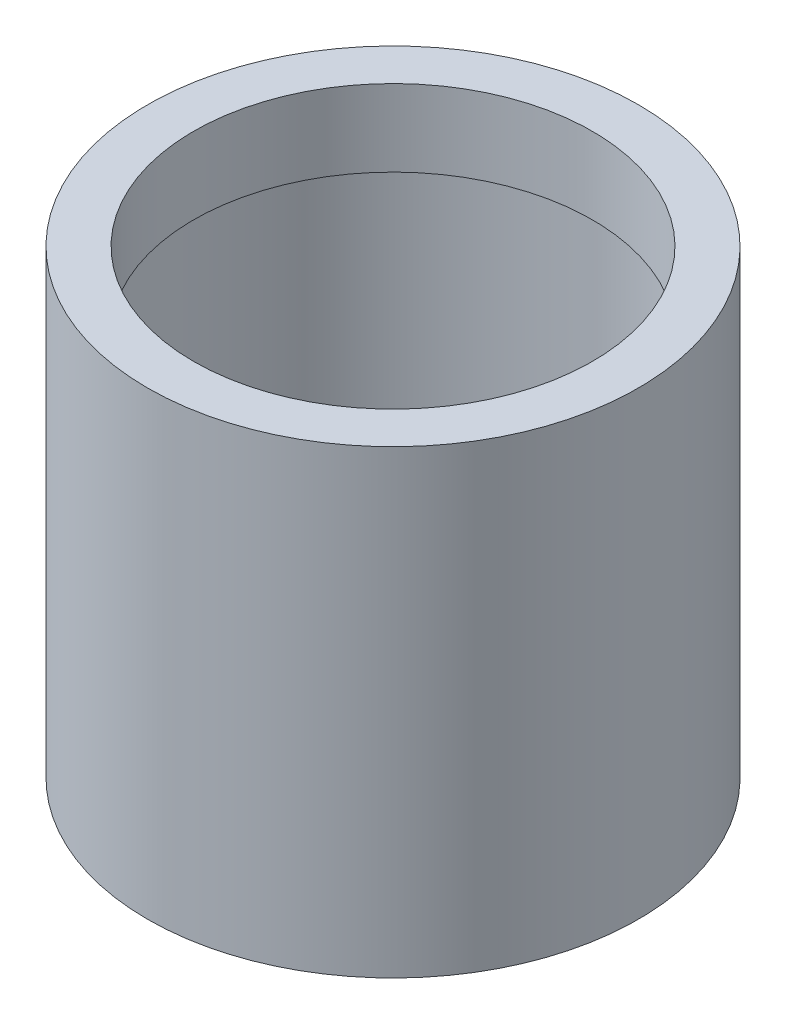
ISO-10303-21;
HEADER;
FILE_DESCRIPTION(('STEP AP214'),'2;1');
FILE_NAME('part.step','',(''),(''),'','','');
FILE_SCHEMA(('AUTOMOTIVE_DESIGN { 1 0 10303 214 1 1 1 1 }'));
ENDSEC;
DATA;
#1=APPLICATION_CONTEXT('core data for automotive mechanical design processes');
#2=APPLICATION_PROTOCOL_DEFINITION('international standard','automotive_design',2000,#1);
#3=PRODUCT_CONTEXT('',#1,'mechanical');
#4=PRODUCT('Part','Part','',(#3));
#5=PRODUCT_RELATED_PRODUCT_CATEGORY('part','',(#4));
#6=PRODUCT_DEFINITION_FORMATION('','',#4);
#7=PRODUCT_DEFINITION_CONTEXT('part definition',#1,'design');
#8=PRODUCT_DEFINITION('design','',#6,#7);
#9=PRODUCT_DEFINITION_SHAPE('','',#8);
#10=(LENGTH_UNIT() NAMED_UNIT(*) SI_UNIT(.MILLI.,.METRE.));
#11=(NAMED_UNIT(*) PLANE_ANGLE_UNIT() SI_UNIT($,.RADIAN.));
#12=(NAMED_UNIT(*) SI_UNIT($,.STERADIAN.) SOLID_ANGLE_UNIT());
#13=UNCERTAINTY_MEASURE_WITH_UNIT(LENGTH_MEASURE(1.E-05),#10,'distance_accuracy_value','');
#14=(GEOMETRIC_REPRESENTATION_CONTEXT(3) GLOBAL_UNCERTAINTY_ASSIGNED_CONTEXT((#13)) GLOBAL_UNIT_ASSIGNED_CONTEXT((#10,
#11,#12)) REPRESENTATION_CONTEXT('',''));
#15=CARTESIAN_POINT('',(0.,0.,0.));
#16=DIRECTION('',(0.,0.,1.));
#17=DIRECTION('',(1.,0.,0.));
#18=AXIS2_PLACEMENT_3D('',#15,#16,#17);
#19=CARTESIAN_POINT('',(0.,0.,0.));
#20=DIRECTION('',(0.,1.,0.));
#21=DIRECTION('',(0.,0.,1.));
#22=AXIS2_PLACEMENT_3D('',#19,#20,#21);
#23=PLANE('',#22);
#24=CARTESIAN_POINT('',(0.,0.,0.));
#25=DIRECTION('',(0.,1.,0.));
#26=DIRECTION('',(0.,0.,1.));
#27=AXIS2_PLACEMENT_3D('',#24,#25,#26);
#28=CIRCLE('',#27,16.);
#29=CARTESIAN_POINT('',(0.,0.,16.));
#30=VERTEX_POINT('',#29);
#31=EDGE_CURVE('E10',#30,#30,#28,.T.);
#32=ORIENTED_EDGE('',*,*,#31,.F.);
#33=EDGE_LOOP('',(#32));
#34=FACE_BOUND('',#33,.T.);
#35=CARTESIAN_POINT('',(0.,0.,0.));
#36=DIRECTION('',(0.,1.,0.));
#37=DIRECTION('',(0.,0.,1.));
#38=AXIS2_PLACEMENT_3D('',#35,#36,#37);
#39=CIRCLE('',#38,14.5);
#40=CARTESIAN_POINT('',(0.,0.,14.5));
#41=VERTEX_POINT('',#40);
#42=EDGE_CURVE('E39',#41,#41,#39,.T.);
#43=ORIENTED_EDGE('',*,*,#42,.T.);
#44=EDGE_LOOP('',(#43));
#45=FACE_BOUND('',#44,.T.);
#46=ADVANCED_FACE('F32',(#34,#45),#23,.F.);
#47=CARTESIAN_POINT('',(0.,25.,0.));
#48=DIRECTION('',(0.,-1.,0.));
#49=DIRECTION('',(0.,0.,-1.));
#50=AXIS2_PLACEMENT_3D('',#47,#48,#49);
#51=CYLINDRICAL_SURFACE('',#50,16.);
#52=ORIENTED_EDGE('',*,*,#31,.T.);
#53=EDGE_LOOP('',(#52));
#54=FACE_BOUND('',#53,.T.);
#55=CARTESIAN_POINT('',(0.,30.,0.));
#56=DIRECTION('',(0.,1.,0.));
#57=DIRECTION('',(0.,0.,1.));
#58=AXIS2_PLACEMENT_3D('',#55,#56,#57);
#59=CIRCLE('',#58,16.);
#60=CARTESIAN_POINT('',(0.,30.,16.));
#61=VERTEX_POINT('',#60);
#62=EDGE_CURVE('E47',#61,#61,#59,.T.);
#63=ORIENTED_EDGE('',*,*,#62,.F.);
#64=EDGE_LOOP('',(#63));
#65=FACE_BOUND('',#64,.T.);
#66=ADVANCED_FACE('F34',(#54,#65),#51,.T.);
#67=CARTESIAN_POINT('',(0.,25.,0.));
#68=DIRECTION('',(0.,-1.,0.));
#69=DIRECTION('',(0.,0.,-1.));
#70=AXIS2_PLACEMENT_3D('',#67,#68,#69);
#71=CYLINDRICAL_SURFACE('',#70,14.5);
#72=CARTESIAN_POINT('',(0.,25.,0.));
#73=DIRECTION('',(0.,1.,0.));
#74=DIRECTION('',(0.,0.,1.));
#75=AXIS2_PLACEMENT_3D('',#72,#73,#74);
#76=CIRCLE('',#75,14.5);
#77=CARTESIAN_POINT('',(0.,25.,14.5));
#78=VERTEX_POINT('',#77);
#79=EDGE_CURVE('E43',#78,#78,#76,.T.);
#80=ORIENTED_EDGE('',*,*,#79,.T.);
#81=EDGE_LOOP('',(#80));
#82=FACE_BOUND('',#81,.T.);
#83=ORIENTED_EDGE('',*,*,#42,.F.);
#84=EDGE_LOOP('',(#83));
#85=FACE_BOUND('',#84,.T.);
#86=ADVANCED_FACE('F65',(#82,#85),#71,.F.);
#87=CARTESIAN_POINT('',(0.,30.,0.));
#88=DIRECTION('',(0.,1.,0.));
#89=DIRECTION('',(0.,0.,1.));
#90=AXIS2_PLACEMENT_3D('',#87,#88,#89);
#91=PLANE('',#90);
#92=ORIENTED_EDGE('',*,*,#62,.T.);
#93=EDGE_LOOP('',(#92));
#94=FACE_BOUND('',#93,.T.);
#95=CARTESIAN_POINT('',(0.,30.,0.));
#96=DIRECTION('',(0.,1.,0.));
#97=DIRECTION('',(0.,0.,1.));
#98=AXIS2_PLACEMENT_3D('',#95,#96,#97);
#99=CIRCLE('',#98,13.);
#100=CARTESIAN_POINT('',(0.,30.,13.));
#101=VERTEX_POINT('',#100);
#102=EDGE_CURVE('E52',#101,#101,#99,.T.);
#103=ORIENTED_EDGE('',*,*,#102,.F.);
#104=EDGE_LOOP('',(#103));
#105=FACE_BOUND('',#104,.T.);
#106=ADVANCED_FACE('F62',(#94,#105),#91,.T.);
#107=CARTESIAN_POINT('',(0.,25.,0.));
#108=DIRECTION('',(0.,1.,0.));
#109=DIRECTION('',(0.,0.,1.));
#110=AXIS2_PLACEMENT_3D('',#107,#108,#109);
#111=PLANE('',#110);
#112=ORIENTED_EDGE('',*,*,#79,.F.);
#113=EDGE_LOOP('',(#112));
#114=FACE_BOUND('',#113,.T.);
#115=CARTESIAN_POINT('',(0.,25.,0.));
#116=DIRECTION('',(0.,1.,0.));
#117=DIRECTION('',(0.,0.,1.));
#118=AXIS2_PLACEMENT_3D('',#115,#116,#117);
#119=CIRCLE('',#118,13.);
#120=CARTESIAN_POINT('',(0.,25.,13.));
#121=VERTEX_POINT('',#120);
#122=EDGE_CURVE('E53',#121,#121,#119,.T.);
#123=ORIENTED_EDGE('',*,*,#122,.T.);
#124=EDGE_LOOP('',(#123));
#125=FACE_BOUND('',#124,.T.);
#126=ADVANCED_FACE('F64',(#114,#125),#111,.F.);
#127=CARTESIAN_POINT('',(0.,30.,0.));
#128=DIRECTION('',(0.,-1.,0.));
#129=DIRECTION('',(0.,0.,-1.));
#130=AXIS2_PLACEMENT_3D('',#127,#128,#129);
#131=CYLINDRICAL_SURFACE('',#130,13.);
#132=ORIENTED_EDGE('',*,*,#102,.T.);
#133=EDGE_LOOP('',(#132));
#134=FACE_BOUND('',#133,.T.);
#135=ORIENTED_EDGE('',*,*,#122,.F.);
#136=EDGE_LOOP('',(#135));
#137=FACE_BOUND('',#136,.T.);
#138=ADVANCED_FACE('F59',(#134,#137),#131,.F.);
#139=CLOSED_SHELL('',(#46,#66,#86,#106,#126,#138));
#140=MANIFOLD_SOLID_BREP('B2',#139);
#141=ADVANCED_BREP_SHAPE_REPRESENTATION('',(#18,#140),#14);
#142=SHAPE_DEFINITION_REPRESENTATION(#9,#141);
ENDSEC;
END-ISO-10303-21;
